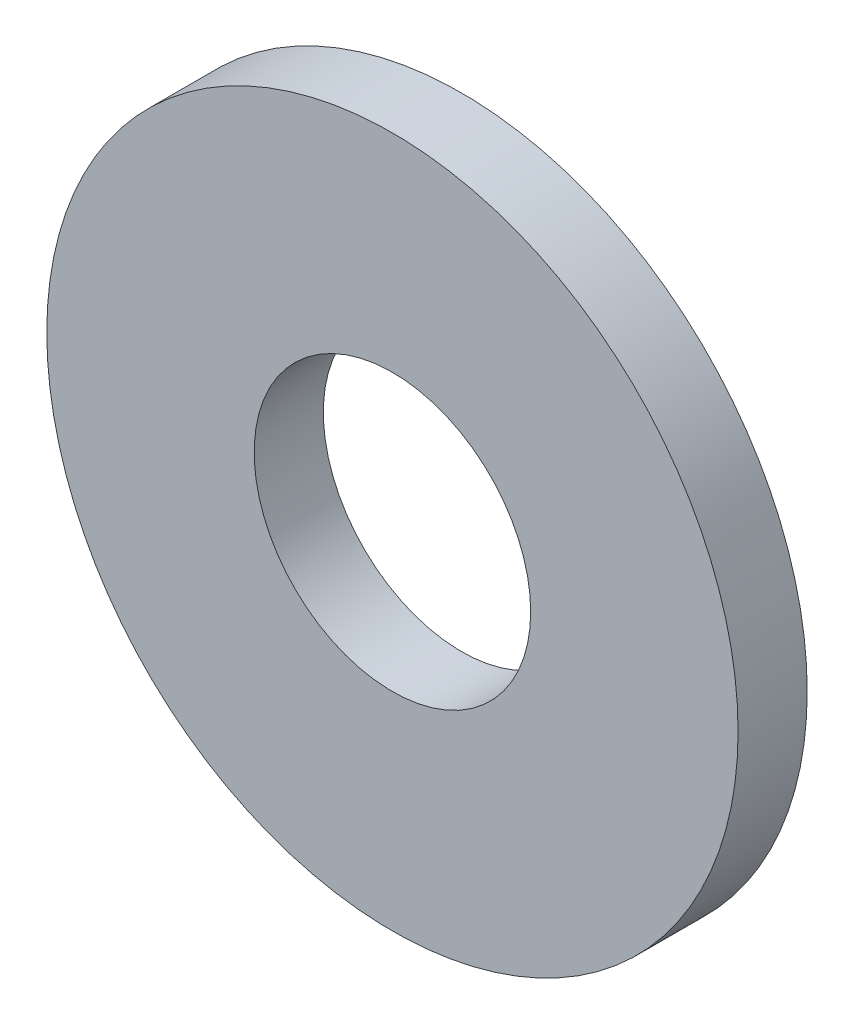
ISO-10303-21;
HEADER;
FILE_DESCRIPTION(('STEP AP214'),'2;1');
FILE_NAME('part.step','',(''),(''),'','','');
FILE_SCHEMA(('AUTOMOTIVE_DESIGN { 1 0 10303 214 1 1 1 1 }'));
ENDSEC;
DATA;
#1=APPLICATION_CONTEXT('core data for automotive mechanical design processes');
#2=APPLICATION_PROTOCOL_DEFINITION('international standard','automotive_design',2000,#1);
#3=PRODUCT_CONTEXT('',#1,'mechanical');
#4=PRODUCT('Part','Part','',(#3));
#5=PRODUCT_RELATED_PRODUCT_CATEGORY('part','',(#4));
#6=PRODUCT_DEFINITION_FORMATION('','',#4);
#7=PRODUCT_DEFINITION_CONTEXT('part definition',#1,'design');
#8=PRODUCT_DEFINITION('design','',#6,#7);
#9=PRODUCT_DEFINITION_SHAPE('','',#8);
#10=(LENGTH_UNIT() NAMED_UNIT(*) SI_UNIT(.MILLI.,.METRE.));
#11=(NAMED_UNIT(*) PLANE_ANGLE_UNIT() SI_UNIT($,.RADIAN.));
#12=(NAMED_UNIT(*) SI_UNIT($,.STERADIAN.) SOLID_ANGLE_UNIT());
#13=UNCERTAINTY_MEASURE_WITH_UNIT(LENGTH_MEASURE(1.E-05),#10,'distance_accuracy_value','');
#14=(GEOMETRIC_REPRESENTATION_CONTEXT(3) GLOBAL_UNCERTAINTY_ASSIGNED_CONTEXT((#13)) GLOBAL_UNIT_ASSIGNED_CONTEXT((#10,
#11,#12)) REPRESENTATION_CONTEXT('',''));
#15=CARTESIAN_POINT('',(0.,0.,0.));
#16=DIRECTION('',(0.,0.,1.));
#17=DIRECTION('',(1.,0.,0.));
#18=AXIS2_PLACEMENT_3D('',#15,#16,#17);
#19=CARTESIAN_POINT('',(0.,0.,3.175));
#20=DIRECTION('',(0.,0.,-1.));
#21=DIRECTION('',(-1.,0.,0.));
#22=AXIS2_PLACEMENT_3D('',#19,#20,#21);
#23=CYLINDRICAL_SURFACE('',#22,15.875);
#24=CARTESIAN_POINT('',(0.,0.,3.175));
#25=DIRECTION('',(0.,0.,1.));
#26=DIRECTION('',(1.,0.,0.));
#27=AXIS2_PLACEMENT_3D('',#24,#25,#26);
#28=CIRCLE('',#27,15.875);
#29=CARTESIAN_POINT('',(15.875,0.,3.175));
#30=VERTEX_POINT('',#29);
#31=EDGE_CURVE('E10',#30,#30,#28,.T.);
#32=ORIENTED_EDGE('',*,*,#31,.F.);
#33=EDGE_LOOP('',(#32));
#34=FACE_BOUND('',#33,.T.);
#35=CARTESIAN_POINT('',(0.,0.,0.));
#36=DIRECTION('',(0.,0.,1.));
#37=DIRECTION('',(1.,0.,0.));
#38=AXIS2_PLACEMENT_3D('',#35,#36,#37);
#39=CIRCLE('',#38,15.875);
#40=CARTESIAN_POINT('',(15.875,0.,0.));
#41=VERTEX_POINT('',#40);
#42=EDGE_CURVE('E42',#41,#41,#39,.T.);
#43=ORIENTED_EDGE('',*,*,#42,.T.);
#44=EDGE_LOOP('',(#43));
#45=FACE_BOUND('',#44,.T.);
#46=ADVANCED_FACE('F39',(#34,#45),#23,.T.);
#47=CARTESIAN_POINT('',(0.,0.,3.175));
#48=DIRECTION('',(0.,0.,1.));
#49=DIRECTION('',(1.,0.,0.));
#50=AXIS2_PLACEMENT_3D('',#47,#48,#49);
#51=PLANE('',#50);
#52=CARTESIAN_POINT('',(0.,0.,3.175));
#53=DIRECTION('',(0.,0.,1.));
#54=DIRECTION('',(1.,0.,0.));
#55=AXIS2_PLACEMENT_3D('',#52,#53,#54);
#56=CIRCLE('',#55,6.35);
#57=CARTESIAN_POINT('',(6.35,0.,3.175));
#58=VERTEX_POINT('',#57);
#59=EDGE_CURVE('E49',#58,#58,#56,.T.);
#60=ORIENTED_EDGE('',*,*,#59,.F.);
#61=EDGE_LOOP('',(#60));
#62=FACE_BOUND('',#61,.T.);
#63=ORIENTED_EDGE('',*,*,#31,.T.);
#64=EDGE_LOOP('',(#63));
#65=FACE_BOUND('',#64,.T.);
#66=ADVANCED_FACE('F66',(#62,#65),#51,.T.);
#67=CARTESIAN_POINT('',(0.,0.,0.));
#68=DIRECTION('',(0.,0.,1.));
#69=DIRECTION('',(1.,0.,0.));
#70=AXIS2_PLACEMENT_3D('',#67,#68,#69);
#71=PLANE('',#70);
#72=CARTESIAN_POINT('',(0.,0.,0.));
#73=DIRECTION('',(0.,0.,1.));
#74=DIRECTION('',(1.,0.,0.));
#75=AXIS2_PLACEMENT_3D('',#72,#73,#74);
#76=CIRCLE('',#75,6.35);
#77=CARTESIAN_POINT('',(6.35,0.,0.));
#78=VERTEX_POINT('',#77);
#79=EDGE_CURVE('E53',#78,#78,#76,.T.);
#80=ORIENTED_EDGE('',*,*,#79,.T.);
#81=EDGE_LOOP('',(#80));
#82=FACE_BOUND('',#81,.T.);
#83=ORIENTED_EDGE('',*,*,#42,.F.);
#84=EDGE_LOOP('',(#83));
#85=FACE_BOUND('',#84,.T.);
#86=ADVANCED_FACE('F57',(#82,#85),#71,.F.);
#87=CARTESIAN_POINT('',(0.,0.,21.1355122421383));
#88=DIRECTION('',(0.,0.,-1.));
#89=DIRECTION('',(-1.,0.,0.));
#90=AXIS2_PLACEMENT_3D('',#87,#88,#89);
#91=CYLINDRICAL_SURFACE('',#90,6.35);
#92=ORIENTED_EDGE('',*,*,#79,.F.);
#93=EDGE_LOOP('',(#92));
#94=FACE_BOUND('',#93,.T.);
#95=ORIENTED_EDGE('',*,*,#59,.T.);
#96=EDGE_LOOP('',(#95));
#97=FACE_BOUND('',#96,.T.);
#98=ADVANCED_FACE('F60',(#94,#97),#91,.F.);
#99=CLOSED_SHELL('',(#46,#66,#86,#98));
#100=MANIFOLD_SOLID_BREP('B2',#99);
#101=ADVANCED_BREP_SHAPE_REPRESENTATION('',(#18,#100),#14);
#102=SHAPE_DEFINITION_REPRESENTATION(#9,#101);
ENDSEC;
END-ISO-10303-21;
